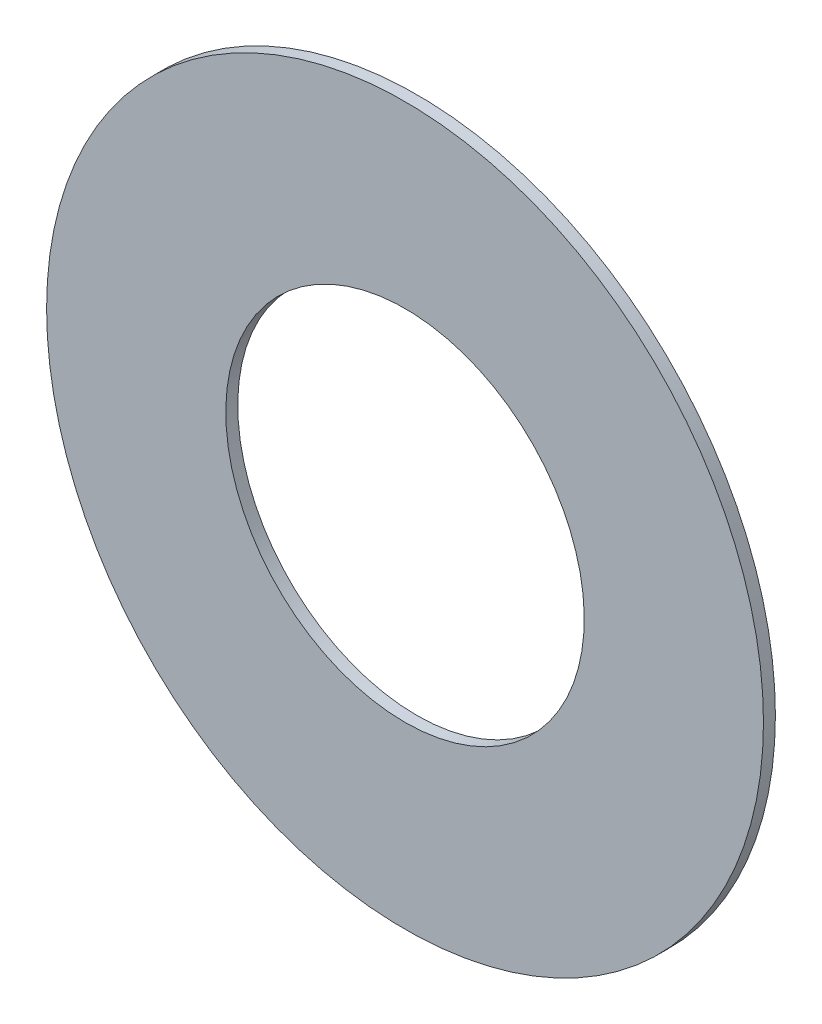
ISO-10303-21;
HEADER;
FILE_DESCRIPTION(('STEP AP214'),'2;1');
FILE_NAME('part.step','',(''),(''),'','','');
FILE_SCHEMA(('AUTOMOTIVE_DESIGN { 1 0 10303 214 1 1 1 1 }'));
ENDSEC;
DATA;
#1=APPLICATION_CONTEXT('core data for automotive mechanical design processes');
#2=APPLICATION_PROTOCOL_DEFINITION('international standard','automotive_design',2000,#1);
#3=PRODUCT_CONTEXT('',#1,'mechanical');
#4=PRODUCT('Part','Part','',(#3));
#5=PRODUCT_RELATED_PRODUCT_CATEGORY('part','',(#4));
#6=PRODUCT_DEFINITION_FORMATION('','',#4);
#7=PRODUCT_DEFINITION_CONTEXT('part definition',#1,'design');
#8=PRODUCT_DEFINITION('design','',#6,#7);
#9=PRODUCT_DEFINITION_SHAPE('','',#8);
#10=(LENGTH_UNIT() NAMED_UNIT(*) SI_UNIT(.MILLI.,.METRE.));
#11=(NAMED_UNIT(*) PLANE_ANGLE_UNIT() SI_UNIT($,.RADIAN.));
#12=(NAMED_UNIT(*) SI_UNIT($,.STERADIAN.) SOLID_ANGLE_UNIT());
#13=UNCERTAINTY_MEASURE_WITH_UNIT(LENGTH_MEASURE(1.E-05),#10,'distance_accuracy_value','');
#14=(GEOMETRIC_REPRESENTATION_CONTEXT(3) GLOBAL_UNCERTAINTY_ASSIGNED_CONTEXT((#13)) GLOBAL_UNIT_ASSIGNED_CONTEXT((#10,
#11,#12)) REPRESENTATION_CONTEXT('',''));
#15=CARTESIAN_POINT('',(0.,0.,0.));
#16=DIRECTION('',(0.,0.,1.));
#17=DIRECTION('',(1.,0.,0.));
#18=AXIS2_PLACEMENT_3D('',#15,#16,#17);
#19=CARTESIAN_POINT('',(136.902,-111.734,-0.045));
#20=DIRECTION('',(0.,0.,-1.));
#21=DIRECTION('',(0.,-1.,0.));
#22=AXIS2_PLACEMENT_3D('',#19,#20,#21);
#23=CYLINDRICAL_SURFACE('',#22,0.525);
#24=CARTESIAN_POINT('',(136.902,-111.734,1.67));
#25=DIRECTION('',(0.,0.,-1.));
#26=DIRECTION('',(0.,-1.,0.));
#27=AXIS2_PLACEMENT_3D('',#24,#25,#26);
#28=CIRCLE('',#27,0.525);
#29=CARTESIAN_POINT('',(136.902,-112.259,1.67));
#30=VERTEX_POINT('',#29);
#31=EDGE_CURVE('E26',#30,#30,#28,.T.);
#32=ORIENTED_EDGE('',*,*,#31,.T.);
#33=DIRECTION('',(0.,0.,1.));
#34=VECTOR('',#33,1.);
#35=CARTESIAN_POINT('',(136.902,-112.259,-0.045));
#36=LINE('',#35,#34);
#37=CARTESIAN_POINT('',(136.902,-112.259,1.705));
#38=VERTEX_POINT('',#37);
#39=EDGE_CURVE('E11',#30,#38,#36,.T.);
#40=ORIENTED_EDGE('',*,*,#39,.T.);
#41=CARTESIAN_POINT('',(136.902,-111.734,1.705));
#42=DIRECTION('',(0.,0.,-1.));
#43=DIRECTION('',(0.,-1.,0.));
#44=AXIS2_PLACEMENT_3D('',#41,#42,#43);
#45=CIRCLE('',#44,0.525);
#46=EDGE_CURVE('E55',#38,#38,#45,.T.);
#47=ORIENTED_EDGE('',*,*,#46,.F.);
#48=ORIENTED_EDGE('',*,*,#39,.F.);
#49=EDGE_LOOP('',(#32,#40,#47,#48));
#50=FACE_BOUND('',#49,.T.);
#51=ADVANCED_FACE('F17',(#50),#23,.F.);
#52=CARTESIAN_POINT('',(136.902,-111.734,1.67));
#53=DIRECTION('',(0.,0.,1.));
#54=DIRECTION('',(1.,0.,0.));
#55=AXIS2_PLACEMENT_3D('',#52,#53,#54);
#56=PLANE('',#55);
#57=ORIENTED_EDGE('',*,*,#31,.F.);
#58=EDGE_LOOP('',(#57));
#59=FACE_BOUND('',#58,.T.);
#60=CARTESIAN_POINT('',(136.902,-111.734,1.67));
#61=DIRECTION('',(0.,0.,1.));
#62=DIRECTION('',(1.,0.,0.));
#63=AXIS2_PLACEMENT_3D('',#60,#61,#62);
#64=CIRCLE('',#63,1.05);
#65=CARTESIAN_POINT('',(137.952,-111.734,1.67));
#66=VERTEX_POINT('',#65);
#67=EDGE_CURVE('E48',#66,#66,#64,.T.);
#68=ORIENTED_EDGE('',*,*,#67,.F.);
#69=EDGE_LOOP('',(#68));
#70=FACE_BOUND('',#69,.T.);
#71=ADVANCED_FACE('F71',(#59,#70),#56,.F.);
#72=CARTESIAN_POINT('',(136.902,-111.734,1.705));
#73=DIRECTION('',(0.,0.,1.));
#74=DIRECTION('',(1.,0.,0.));
#75=AXIS2_PLACEMENT_3D('',#72,#73,#74);
#76=PLANE('',#75);
#77=ORIENTED_EDGE('',*,*,#46,.T.);
#78=EDGE_LOOP('',(#77));
#79=FACE_BOUND('',#78,.T.);
#80=CARTESIAN_POINT('',(136.902,-111.734,1.705));
#81=DIRECTION('',(0.,0.,1.));
#82=DIRECTION('',(1.,0.,0.));
#83=AXIS2_PLACEMENT_3D('',#80,#81,#82);
#84=CIRCLE('',#83,1.05);
#85=CARTESIAN_POINT('',(137.952,-111.734,1.705));
#86=VERTEX_POINT('',#85);
#87=EDGE_CURVE('E64',#86,#86,#84,.T.);
#88=ORIENTED_EDGE('',*,*,#87,.T.);
#89=EDGE_LOOP('',(#88));
#90=FACE_BOUND('',#89,.T.);
#91=ADVANCED_FACE('F73',(#79,#90),#76,.T.);
#92=CARTESIAN_POINT('',(136.902,-111.734,1.67));
#93=DIRECTION('',(0.,0.,1.));
#94=DIRECTION('',(1.,0.,0.));
#95=AXIS2_PLACEMENT_3D('',#92,#93,#94);
#96=CYLINDRICAL_SURFACE('',#95,1.05);
#97=ORIENTED_EDGE('',*,*,#87,.F.);
#98=DIRECTION('',(0.,0.,1.));
#99=VECTOR('',#98,1.);
#100=CARTESIAN_POINT('',(137.952,-111.734,1.67));
#101=LINE('',#100,#99);
#102=EDGE_CURVE('E51',#66,#86,#101,.T.);
#103=ORIENTED_EDGE('',*,*,#102,.F.);
#104=ORIENTED_EDGE('',*,*,#67,.T.);
#105=ORIENTED_EDGE('',*,*,#102,.T.);
#106=EDGE_LOOP('',(#97,#103,#104,#105));
#107=FACE_BOUND('',#106,.T.);
#108=ADVANCED_FACE('F50',(#107),#96,.T.);
#109=CLOSED_SHELL('',(#51,#71,#91,#108));
#110=MANIFOLD_SOLID_BREP('B1',#109);
#111=ADVANCED_BREP_SHAPE_REPRESENTATION('',(#18,#110),#14);
#112=SHAPE_DEFINITION_REPRESENTATION(#9,#111);
ENDSEC;
END-ISO-10303-21;
